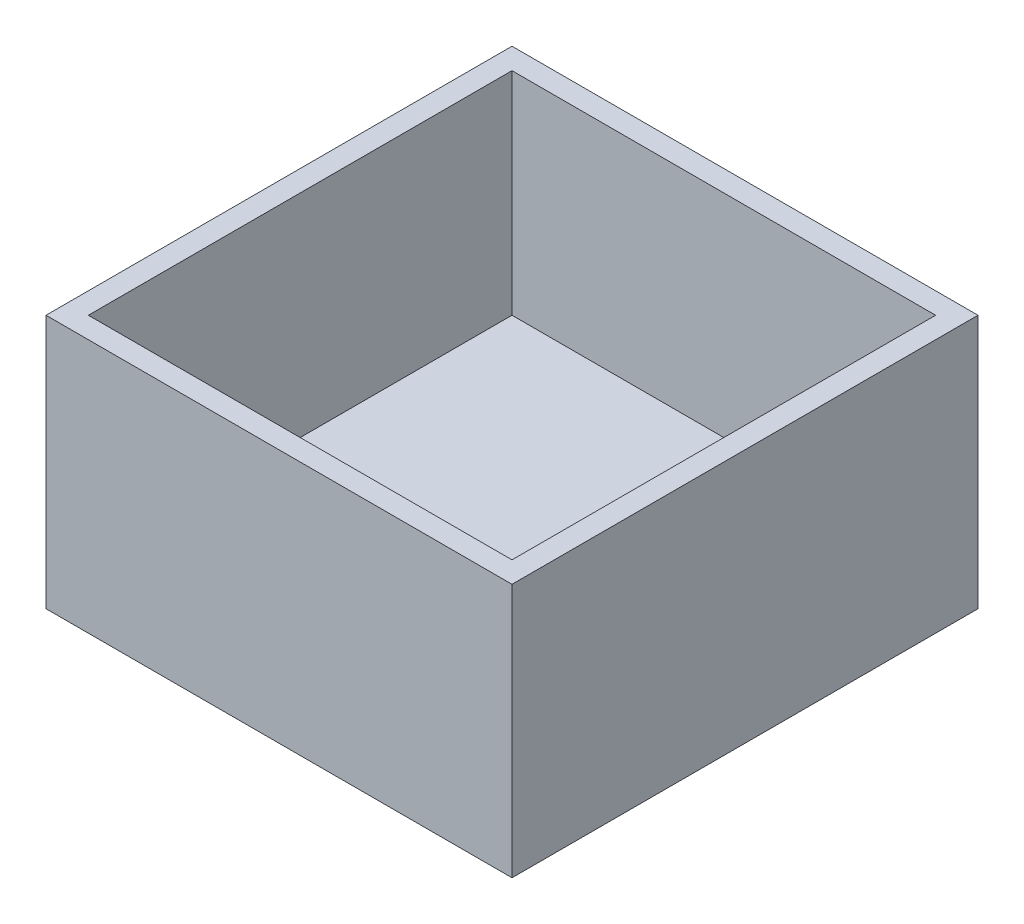
ISO-10303-21;
HEADER;
FILE_DESCRIPTION(('STEP AP214'),'2;1');
FILE_NAME('part.step','',(''),(''),'','','');
FILE_SCHEMA(('AUTOMOTIVE_DESIGN { 1 0 10303 214 1 1 1 1 }'));
ENDSEC;
DATA;
#1=APPLICATION_CONTEXT('core data for automotive mechanical design processes');
#2=APPLICATION_PROTOCOL_DEFINITION('international standard','automotive_design',2000,#1);
#3=PRODUCT_CONTEXT('',#1,'mechanical');
#4=PRODUCT('Part','Part','',(#3));
#5=PRODUCT_RELATED_PRODUCT_CATEGORY('part','',(#4));
#6=PRODUCT_DEFINITION_FORMATION('','',#4);
#7=PRODUCT_DEFINITION_CONTEXT('part definition',#1,'design');
#8=PRODUCT_DEFINITION('design','',#6,#7);
#9=PRODUCT_DEFINITION_SHAPE('','',#8);
#10=(LENGTH_UNIT() NAMED_UNIT(*) SI_UNIT(.MILLI.,.METRE.));
#11=(NAMED_UNIT(*) PLANE_ANGLE_UNIT() SI_UNIT($,.RADIAN.));
#12=(NAMED_UNIT(*) SI_UNIT($,.STERADIAN.) SOLID_ANGLE_UNIT());
#13=UNCERTAINTY_MEASURE_WITH_UNIT(LENGTH_MEASURE(1.E-05),#10,'distance_accuracy_value','');
#14=(GEOMETRIC_REPRESENTATION_CONTEXT(3) GLOBAL_UNCERTAINTY_ASSIGNED_CONTEXT((#13)) GLOBAL_UNIT_ASSIGNED_CONTEXT((#10,
#11,#12)) REPRESENTATION_CONTEXT('',''));
#15=CARTESIAN_POINT('',(0.,0.,0.));
#16=DIRECTION('',(0.,0.,1.));
#17=DIRECTION('',(1.,0.,0.));
#18=AXIS2_PLACEMENT_3D('',#15,#16,#17);
#19=CARTESIAN_POINT('',(10.,12.,10.));
#20=DIRECTION('',(-1.,0.,0.));
#21=DIRECTION('',(0.,0.,1.));
#22=AXIS2_PLACEMENT_3D('',#19,#20,#21);
#23=PLANE('',#22);
#24=DIRECTION('',(0.,-1.,0.));
#25=VECTOR('',#24,1.);
#26=CARTESIAN_POINT('',(10.,12.,-10.));
#27=LINE('',#26,#25);
#28=CARTESIAN_POINT('',(10.,12.,-10.));
#29=VERTEX_POINT('',#28);
#30=CARTESIAN_POINT('',(10.,2.,-10.));
#31=VERTEX_POINT('',#30);
#32=EDGE_CURVE('E116',#29,#31,#27,.T.);
#33=ORIENTED_EDGE('',*,*,#32,.T.);
#34=DIRECTION('',(0.,0.,-1.));
#35=VECTOR('',#34,1.);
#36=CARTESIAN_POINT('',(10.,2.,10.));
#37=LINE('',#36,#35);
#38=CARTESIAN_POINT('',(10.,2.,10.));
#39=VERTEX_POINT('',#38);
#40=EDGE_CURVE('E102',#39,#31,#37,.T.);
#41=ORIENTED_EDGE('',*,*,#40,.F.);
#42=DIRECTION('',(0.,-1.,0.));
#43=VECTOR('',#42,1.);
#44=CARTESIAN_POINT('',(10.,12.,10.));
#45=LINE('',#44,#43);
#46=CARTESIAN_POINT('',(10.,12.,10.));
#47=VERTEX_POINT('',#46);
#48=EDGE_CURVE('E209',#47,#39,#45,.T.);
#49=ORIENTED_EDGE('',*,*,#48,.F.);
#50=DIRECTION('',(0.,0.,-1.));
#51=VECTOR('',#50,1.);
#52=CARTESIAN_POINT('',(10.,12.,10.));
#53=LINE('',#52,#51);
#54=EDGE_CURVE('E122',#47,#29,#53,.T.);
#55=ORIENTED_EDGE('',*,*,#54,.T.);
#56=EDGE_LOOP('',(#33,#41,#49,#55));
#57=FACE_BOUND('',#56,.T.);
#58=ADVANCED_FACE('F39',(#57),#23,.T.);
#59=CARTESIAN_POINT('',(-10.,12.,-10.));
#60=DIRECTION('',(0.,0.,1.));
#61=DIRECTION('',(1.,0.,0.));
#62=AXIS2_PLACEMENT_3D('',#59,#60,#61);
#63=PLANE('',#62);
#64=DIRECTION('',(0.,-1.,0.));
#65=VECTOR('',#64,1.);
#66=CARTESIAN_POINT('',(-10.,12.,-10.));
#67=LINE('',#66,#65);
#68=CARTESIAN_POINT('',(-10.,12.,-10.));
#69=VERTEX_POINT('',#68);
#70=CARTESIAN_POINT('',(-10.,2.,-10.));
#71=VERTEX_POINT('',#70);
#72=EDGE_CURVE('E119',#69,#71,#67,.T.);
#73=ORIENTED_EDGE('',*,*,#72,.T.);
#74=DIRECTION('',(-1.,0.,0.));
#75=VECTOR('',#74,1.);
#76=CARTESIAN_POINT('',(-10.,2.,-10.));
#77=LINE('',#76,#75);
#78=EDGE_CURVE('E105',#31,#71,#77,.T.);
#79=ORIENTED_EDGE('',*,*,#78,.F.);
#80=ORIENTED_EDGE('',*,*,#32,.F.);
#81=DIRECTION('',(-1.,0.,0.));
#82=VECTOR('',#81,1.);
#83=CARTESIAN_POINT('',(-10.,12.,-10.));
#84=LINE('',#83,#82);
#85=EDGE_CURVE('E215',#29,#69,#84,.T.);
#86=ORIENTED_EDGE('',*,*,#85,.T.);
#87=EDGE_LOOP('',(#73,#79,#80,#86));
#88=FACE_BOUND('',#87,.T.);
#89=ADVANCED_FACE('F115',(#88),#63,.T.);
#90=CARTESIAN_POINT('',(-10.,12.,10.));
#91=DIRECTION('',(1.,0.,0.));
#92=DIRECTION('',(0.,0.,-1.));
#93=AXIS2_PLACEMENT_3D('',#90,#91,#92);
#94=PLANE('',#93);
#95=DIRECTION('',(0.,-1.,0.));
#96=VECTOR('',#95,1.);
#97=CARTESIAN_POINT('',(-10.,12.,10.));
#98=LINE('',#97,#96);
#99=CARTESIAN_POINT('',(-10.,12.,10.));
#100=VERTEX_POINT('',#99);
#101=CARTESIAN_POINT('',(-10.,2.,10.));
#102=VERTEX_POINT('',#101);
#103=EDGE_CURVE('E61',#100,#102,#98,.T.);
#104=ORIENTED_EDGE('',*,*,#103,.T.);
#105=DIRECTION('',(0.,0.,1.));
#106=VECTOR('',#105,1.);
#107=CARTESIAN_POINT('',(-10.,2.,10.));
#108=LINE('',#107,#106);
#109=EDGE_CURVE('E54',#71,#102,#108,.T.);
#110=ORIENTED_EDGE('',*,*,#109,.F.);
#111=ORIENTED_EDGE('',*,*,#72,.F.);
#112=DIRECTION('',(0.,0.,1.));
#113=VECTOR('',#112,1.);
#114=CARTESIAN_POINT('',(-10.,12.,10.));
#115=LINE('',#114,#113);
#116=EDGE_CURVE('E207',#69,#100,#115,.T.);
#117=ORIENTED_EDGE('',*,*,#116,.T.);
#118=EDGE_LOOP('',(#104,#110,#111,#117));
#119=FACE_BOUND('',#118,.T.);
#120=ADVANCED_FACE('F185',(#119),#94,.T.);
#121=CARTESIAN_POINT('',(-10.,12.,10.));
#122=DIRECTION('',(0.,0.,-1.));
#123=DIRECTION('',(-1.,0.,0.));
#124=AXIS2_PLACEMENT_3D('',#121,#122,#123);
#125=PLANE('',#124);
#126=ORIENTED_EDGE('',*,*,#48,.T.);
#127=DIRECTION('',(1.,0.,0.));
#128=VECTOR('',#127,1.);
#129=CARTESIAN_POINT('',(-10.,2.,10.));
#130=LINE('',#129,#128);
#131=EDGE_CURVE('E106',#102,#39,#130,.T.);
#132=ORIENTED_EDGE('',*,*,#131,.F.);
#133=ORIENTED_EDGE('',*,*,#103,.F.);
#134=DIRECTION('',(1.,0.,0.));
#135=VECTOR('',#134,1.);
#136=CARTESIAN_POINT('',(-10.,12.,10.));
#137=LINE('',#136,#135);
#138=EDGE_CURVE('E210',#100,#47,#137,.T.);
#139=ORIENTED_EDGE('',*,*,#138,.T.);
#140=EDGE_LOOP('',(#126,#132,#133,#139));
#141=FACE_BOUND('',#140,.T.);
#142=ADVANCED_FACE('F191',(#141),#125,.T.);
#143=CARTESIAN_POINT('',(0.,12.,0.));
#144=DIRECTION('',(0.,-1.,0.));
#145=DIRECTION('',(0.,0.,-1.));
#146=AXIS2_PLACEMENT_3D('',#143,#144,#145);
#147=PLANE('',#146);
#148=DIRECTION('',(0.,0.,-1.));
#149=VECTOR('',#148,1.);
#150=CARTESIAN_POINT('',(11.,12.,11.));
#151=LINE('',#150,#149);
#152=CARTESIAN_POINT('',(11.,12.,11.));
#153=VERTEX_POINT('',#152);
#154=CARTESIAN_POINT('',(11.,12.,-11.));
#155=VERTEX_POINT('',#154);
#156=EDGE_CURVE('E131',#153,#155,#151,.T.);
#157=ORIENTED_EDGE('',*,*,#156,.T.);
#158=DIRECTION('',(-1.,0.,0.));
#159=VECTOR('',#158,1.);
#160=CARTESIAN_POINT('',(-11.,12.,-11.));
#161=LINE('',#160,#159);
#162=CARTESIAN_POINT('',(-11.,12.,-11.));
#163=VERTEX_POINT('',#162);
#164=EDGE_CURVE('E134',#155,#163,#161,.T.);
#165=ORIENTED_EDGE('',*,*,#164,.T.);
#166=DIRECTION('',(0.,0.,1.));
#167=VECTOR('',#166,1.);
#168=CARTESIAN_POINT('',(-11.,12.,11.));
#169=LINE('',#168,#167);
#170=CARTESIAN_POINT('',(-11.,12.,11.));
#171=VERTEX_POINT('',#170);
#172=EDGE_CURVE('E137',#163,#171,#169,.T.);
#173=ORIENTED_EDGE('',*,*,#172,.T.);
#174=DIRECTION('',(1.,0.,0.));
#175=VECTOR('',#174,1.);
#176=CARTESIAN_POINT('',(-11.,12.,11.));
#177=LINE('',#176,#175);
#178=EDGE_CURVE('E139',#171,#153,#177,.T.);
#179=ORIENTED_EDGE('',*,*,#178,.T.);
#180=EDGE_LOOP('',(#157,#165,#173,#179));
#181=FACE_BOUND('',#180,.T.);
#182=ORIENTED_EDGE('',*,*,#54,.F.);
#183=ORIENTED_EDGE('',*,*,#138,.F.);
#184=ORIENTED_EDGE('',*,*,#116,.F.);
#185=ORIENTED_EDGE('',*,*,#85,.F.);
#186=EDGE_LOOP('',(#182,#183,#184,#185));
#187=FACE_BOUND('',#186,.T.);
#188=ADVANCED_FACE('F170',(#181,#187),#147,.F.);
#189=CARTESIAN_POINT('',(0.,0.,0.));
#190=DIRECTION('',(0.,-1.,0.));
#191=DIRECTION('',(0.,0.,-1.));
#192=AXIS2_PLACEMENT_3D('',#189,#190,#191);
#193=PLANE('',#192);
#194=DIRECTION('',(0.,0.,-1.));
#195=VECTOR('',#194,1.);
#196=CARTESIAN_POINT('',(11.,0.,11.));
#197=LINE('',#196,#195);
#198=CARTESIAN_POINT('',(11.,0.,11.));
#199=VERTEX_POINT('',#198);
#200=CARTESIAN_POINT('',(11.,0.,-11.));
#201=VERTEX_POINT('',#200);
#202=EDGE_CURVE('E123',#199,#201,#197,.T.);
#203=ORIENTED_EDGE('',*,*,#202,.F.);
#204=DIRECTION('',(1.,0.,0.));
#205=VECTOR('',#204,1.);
#206=CARTESIAN_POINT('',(-11.,0.,11.));
#207=LINE('',#206,#205);
#208=CARTESIAN_POINT('',(-11.,0.,11.));
#209=VERTEX_POINT('',#208);
#210=EDGE_CURVE('E135',#209,#199,#207,.T.);
#211=ORIENTED_EDGE('',*,*,#210,.F.);
#212=DIRECTION('',(0.,0.,1.));
#213=VECTOR('',#212,1.);
#214=CARTESIAN_POINT('',(-11.,0.,11.));
#215=LINE('',#214,#213);
#216=CARTESIAN_POINT('',(-11.,0.,-11.));
#217=VERTEX_POINT('',#216);
#218=EDGE_CURVE('E143',#217,#209,#215,.T.);
#219=ORIENTED_EDGE('',*,*,#218,.F.);
#220=DIRECTION('',(-1.,0.,0.));
#221=VECTOR('',#220,1.);
#222=CARTESIAN_POINT('',(-11.,0.,-11.));
#223=LINE('',#222,#221);
#224=EDGE_CURVE('E126',#201,#217,#223,.T.);
#225=ORIENTED_EDGE('',*,*,#224,.F.);
#226=EDGE_LOOP('',(#203,#211,#219,#225));
#227=FACE_BOUND('',#226,.T.);
#228=ADVANCED_FACE('F161',(#227),#193,.T.);
#229=CARTESIAN_POINT('',(11.,12.,11.));
#230=DIRECTION('',(-1.,0.,0.));
#231=DIRECTION('',(0.,0.,1.));
#232=AXIS2_PLACEMENT_3D('',#229,#230,#231);
#233=PLANE('',#232);
#234=ORIENTED_EDGE('',*,*,#202,.T.);
#235=DIRECTION('',(0.,-1.,0.));
#236=VECTOR('',#235,1.);
#237=CARTESIAN_POINT('',(11.,12.,-11.));
#238=LINE('',#237,#236);
#239=EDGE_CURVE('E11',#155,#201,#238,.T.);
#240=ORIENTED_EDGE('',*,*,#239,.F.);
#241=ORIENTED_EDGE('',*,*,#156,.F.);
#242=DIRECTION('',(0.,-1.,0.));
#243=VECTOR('',#242,1.);
#244=CARTESIAN_POINT('',(11.,12.,11.));
#245=LINE('',#244,#243);
#246=EDGE_CURVE('E140',#153,#199,#245,.T.);
#247=ORIENTED_EDGE('',*,*,#246,.T.);
#248=EDGE_LOOP('',(#234,#240,#241,#247));
#249=FACE_BOUND('',#248,.T.);
#250=ADVANCED_FACE('F41',(#249),#233,.F.);
#251=CARTESIAN_POINT('',(-11.,12.,-11.));
#252=DIRECTION('',(0.,0.,1.));
#253=DIRECTION('',(1.,0.,0.));
#254=AXIS2_PLACEMENT_3D('',#251,#252,#253);
#255=PLANE('',#254);
#256=ORIENTED_EDGE('',*,*,#224,.T.);
#257=DIRECTION('',(0.,-1.,0.));
#258=VECTOR('',#257,1.);
#259=CARTESIAN_POINT('',(-11.,12.,-11.));
#260=LINE('',#259,#258);
#261=EDGE_CURVE('E47',#163,#217,#260,.T.);
#262=ORIENTED_EDGE('',*,*,#261,.F.);
#263=ORIENTED_EDGE('',*,*,#164,.F.);
#264=ORIENTED_EDGE('',*,*,#239,.T.);
#265=EDGE_LOOP('',(#256,#262,#263,#264));
#266=FACE_BOUND('',#265,.T.);
#267=ADVANCED_FACE('F172',(#266),#255,.F.);
#268=CARTESIAN_POINT('',(-11.,12.,11.));
#269=DIRECTION('',(1.,0.,0.));
#270=DIRECTION('',(0.,0.,-1.));
#271=AXIS2_PLACEMENT_3D('',#268,#269,#270);
#272=PLANE('',#271);
#273=ORIENTED_EDGE('',*,*,#218,.T.);
#274=DIRECTION('',(0.,-1.,0.));
#275=VECTOR('',#274,1.);
#276=CARTESIAN_POINT('',(-11.,12.,11.));
#277=LINE('',#276,#275);
#278=EDGE_CURVE('E148',#171,#209,#277,.T.);
#279=ORIENTED_EDGE('',*,*,#278,.F.);
#280=ORIENTED_EDGE('',*,*,#172,.F.);
#281=ORIENTED_EDGE('',*,*,#261,.T.);
#282=EDGE_LOOP('',(#273,#279,#280,#281));
#283=FACE_BOUND('',#282,.T.);
#284=ADVANCED_FACE('F155',(#283),#272,.F.);
#285=CARTESIAN_POINT('',(-11.,12.,11.));
#286=DIRECTION('',(0.,0.,-1.));
#287=DIRECTION('',(-1.,0.,0.));
#288=AXIS2_PLACEMENT_3D('',#285,#286,#287);
#289=PLANE('',#288);
#290=ORIENTED_EDGE('',*,*,#210,.T.);
#291=ORIENTED_EDGE('',*,*,#246,.F.);
#292=ORIENTED_EDGE('',*,*,#178,.F.);
#293=ORIENTED_EDGE('',*,*,#278,.T.);
#294=EDGE_LOOP('',(#290,#291,#292,#293));
#295=FACE_BOUND('',#294,.T.);
#296=ADVANCED_FACE('F164',(#295),#289,.F.);
#297=CARTESIAN_POINT('',(0.,2.,0.));
#298=DIRECTION('',(0.,-1.,0.));
#299=DIRECTION('',(0.,0.,-1.));
#300=AXIS2_PLACEMENT_3D('',#297,#298,#299);
#301=PLANE('',#300);
#302=ORIENTED_EDGE('',*,*,#40,.T.);
#303=ORIENTED_EDGE('',*,*,#78,.T.);
#304=ORIENTED_EDGE('',*,*,#109,.T.);
#305=ORIENTED_EDGE('',*,*,#131,.T.);
#306=EDGE_LOOP('',(#302,#303,#304,#305));
#307=FACE_BOUND('',#306,.T.);
#308=ADVANCED_FACE('F104',(#307),#301,.F.);
#309=CLOSED_SHELL('',(#58,#89,#120,#142,#188,#228,#250,#267,#284,#296,#308));
#310=MANIFOLD_SOLID_BREP('B2',#309);
#311=ADVANCED_BREP_SHAPE_REPRESENTATION('',(#18,#310),#14);
#312=SHAPE_DEFINITION_REPRESENTATION(#9,#311);
ENDSEC;
END-ISO-10303-21;
